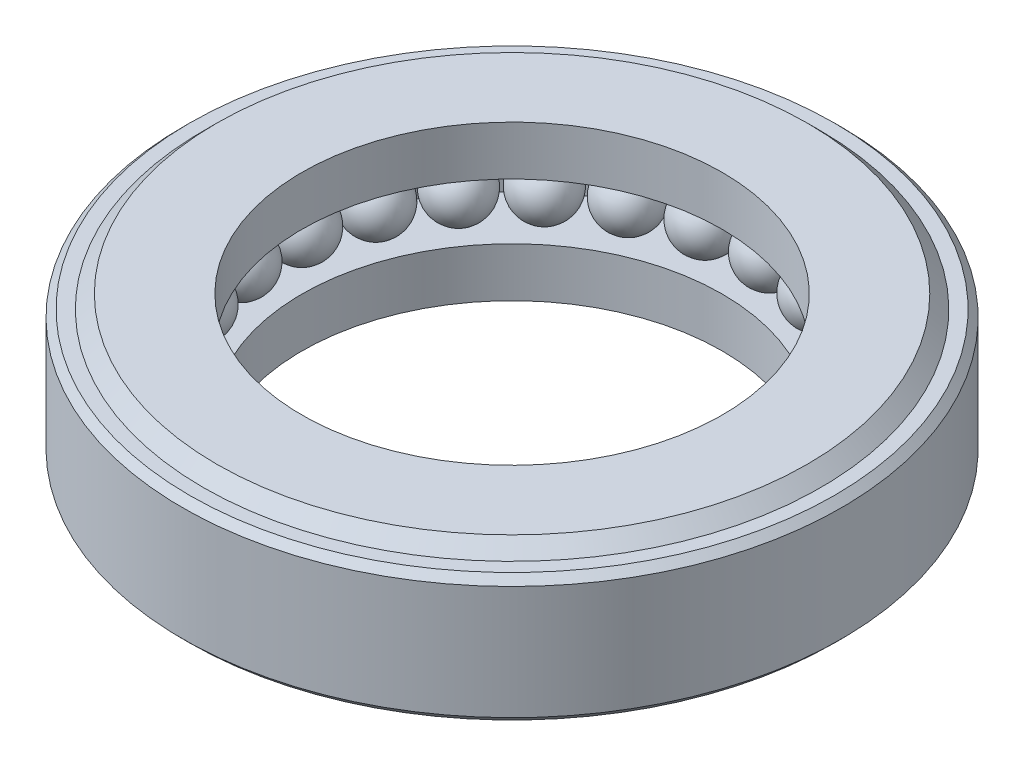
ISO-10303-21;
HEADER;
FILE_DESCRIPTION(('STEP AP214'),'2;1');
FILE_NAME('part.step','',(''),(''),'','','');
FILE_SCHEMA(('AUTOMOTIVE_DESIGN { 1 0 10303 214 1 1 1 1 }'));
ENDSEC;
DATA;
#1=APPLICATION_CONTEXT('core data for automotive mechanical design processes');
#2=APPLICATION_PROTOCOL_DEFINITION('international standard','automotive_design',2000,#1);
#3=PRODUCT_CONTEXT('',#1,'mechanical');
#4=PRODUCT('Part','Part','',(#3));
#5=PRODUCT_RELATED_PRODUCT_CATEGORY('part','',(#4));
#6=PRODUCT_DEFINITION_FORMATION('','',#4);
#7=PRODUCT_DEFINITION_CONTEXT('part definition',#1,'design');
#8=PRODUCT_DEFINITION('design','',#6,#7);
#9=PRODUCT_DEFINITION_SHAPE('','',#8);
#10=(LENGTH_UNIT() NAMED_UNIT(*) SI_UNIT(.MILLI.,.METRE.));
#11=(NAMED_UNIT(*) PLANE_ANGLE_UNIT() SI_UNIT($,.RADIAN.));
#12=(NAMED_UNIT(*) SI_UNIT($,.STERADIAN.) SOLID_ANGLE_UNIT());
#13=UNCERTAINTY_MEASURE_WITH_UNIT(LENGTH_MEASURE(1.E-05),#10,'distance_accuracy_value','');
#14=(GEOMETRIC_REPRESENTATION_CONTEXT(3) GLOBAL_UNCERTAINTY_ASSIGNED_CONTEXT((#13)) GLOBAL_UNIT_ASSIGNED_CONTEXT((#10,
#11,#12)) REPRESENTATION_CONTEXT('',''));
#15=CARTESIAN_POINT('',(0.,0.,0.));
#16=DIRECTION('',(0.,0.,1.));
#17=DIRECTION('',(1.,0.,0.));
#18=AXIS2_PLACEMENT_3D('',#15,#16,#17);
#19=CARTESIAN_POINT('',(2.635,-0.69,0.));
#20=DIRECTION('',(0.,-1.,0.));
#21=DIRECTION('',(0.,0.,-1.));
#22=AXIS2_PLACEMENT_3D('',#19,#20,#21);
#23=PLANE('',#22);
#24=CARTESIAN_POINT('',(0.,-0.69,0.));
#25=DIRECTION('',(0.,-1.,0.));
#26=DIRECTION('',(0.,0.,-1.));
#27=AXIS2_PLACEMENT_3D('',#24,#25,#26);
#28=CIRCLE('',#27,2.635);
#29=CARTESIAN_POINT('',(0.,-0.69,-2.635));
#30=VERTEX_POINT('',#29);
#31=EDGE_CURVE('E10',#30,#30,#28,.T.);
#32=ORIENTED_EDGE('',*,*,#31,.T.);
#33=EDGE_LOOP('',(#32));
#34=FACE_BOUND('',#33,.T.);
#35=CARTESIAN_POINT('',(0.,-0.69,0.));
#36=DIRECTION('',(0.,-1.,0.));
#37=DIRECTION('',(0.,0.,-1.));
#38=AXIS2_PLACEMENT_3D('',#35,#36,#37);
#39=CIRCLE('',#38,1.875);
#40=CARTESIAN_POINT('',(0.,-0.69,-1.875));
#41=VERTEX_POINT('',#40);
#42=EDGE_CURVE('E201',#41,#41,#39,.T.);
#43=ORIENTED_EDGE('',*,*,#42,.F.);
#44=EDGE_LOOP('',(#43));
#45=FACE_BOUND('',#44,.T.);
#46=ADVANCED_FACE('F34',(#34,#45),#23,.T.);
#47=CARTESIAN_POINT('',(0.,-0.69,0.));
#48=DIRECTION('',(0.,1.,0.));
#49=DIRECTION('',(0.,0.,1.));
#50=AXIS2_PLACEMENT_3D('',#47,#48,#49);
#51=CONICAL_SURFACE('',#50,2.635,0.78539816339745);
#52=CARTESIAN_POINT('',(0.,-0.57,0.));
#53=DIRECTION('',(0.,-1.,0.));
#54=DIRECTION('',(0.,0.,-1.));
#55=AXIS2_PLACEMENT_3D('',#52,#53,#54);
#56=CIRCLE('',#55,2.755);
#57=CARTESIAN_POINT('',(0.,-0.57,-2.755));
#58=VERTEX_POINT('',#57);
#59=EDGE_CURVE('E41',#58,#58,#56,.T.);
#60=ORIENTED_EDGE('',*,*,#59,.T.);
#61=EDGE_LOOP('',(#60));
#62=FACE_BOUND('',#61,.T.);
#63=ORIENTED_EDGE('',*,*,#31,.F.);
#64=EDGE_LOOP('',(#63));
#65=FACE_BOUND('',#64,.T.);
#66=ADVANCED_FACE('F251',(#62,#65),#51,.T.);
#67=CARTESIAN_POINT('',(2.8767,-0.57,0.));
#68=DIRECTION('',(0.,-1.,0.));
#69=DIRECTION('',(0.,0.,-1.));
#70=AXIS2_PLACEMENT_3D('',#67,#68,#69);
#71=PLANE('',#70);
#72=CARTESIAN_POINT('',(0.,-0.57,0.));
#73=DIRECTION('',(0.,-1.,0.));
#74=DIRECTION('',(0.,0.,-1.));
#75=AXIS2_PLACEMENT_3D('',#72,#73,#74);
#76=CIRCLE('',#75,2.8767);
#77=CARTESIAN_POINT('',(0.,-0.57,-2.8767));
#78=VERTEX_POINT('',#77);
#79=EDGE_CURVE('E46',#78,#78,#76,.T.);
#80=ORIENTED_EDGE('',*,*,#79,.T.);
#81=EDGE_LOOP('',(#80));
#82=FACE_BOUND('',#81,.T.);
#83=ORIENTED_EDGE('',*,*,#59,.F.);
#84=EDGE_LOOP('',(#83));
#85=FACE_BOUND('',#84,.T.);
#86=ADVANCED_FACE('F236',(#82,#85),#71,.T.);
#87=CARTESIAN_POINT('',(0.,-0.57,0.));
#88=DIRECTION('',(0.,1.,0.));
#89=DIRECTION('',(0.,0.,1.));
#90=AXIS2_PLACEMENT_3D('',#87,#88,#89);
#91=CONICAL_SURFACE('',#90,2.8767,0.78539816339745);
#92=CARTESIAN_POINT('',(0.,-0.5067,0.));
#93=DIRECTION('',(0.,-1.,0.));
#94=DIRECTION('',(0.,0.,-1.));
#95=AXIS2_PLACEMENT_3D('',#92,#93,#94);
#96=CIRCLE('',#95,2.94);
#97=CARTESIAN_POINT('',(0.,-0.5067,-2.94));
#98=VERTEX_POINT('',#97);
#99=EDGE_CURVE('E231',#98,#98,#96,.T.);
#100=ORIENTED_EDGE('',*,*,#99,.T.);
#101=EDGE_LOOP('',(#100));
#102=FACE_BOUND('',#101,.T.);
#103=ORIENTED_EDGE('',*,*,#79,.F.);
#104=EDGE_LOOP('',(#103));
#105=FACE_BOUND('',#104,.T.);
#106=ADVANCED_FACE('F239',(#102,#105),#91,.T.);
#107=CARTESIAN_POINT('',(0.,0.,0.));
#108=DIRECTION('',(0.,-1.,0.));
#109=DIRECTION('',(0.,0.,-1.));
#110=AXIS2_PLACEMENT_3D('',#107,#108,#109);
#111=CYLINDRICAL_SURFACE('',#110,2.94);
#112=CARTESIAN_POINT('',(0.,0.5067,0.));
#113=DIRECTION('',(0.,-1.,0.));
#114=DIRECTION('',(0.,0.,-1.));
#115=AXIS2_PLACEMENT_3D('',#112,#113,#114);
#116=CIRCLE('',#115,2.94);
#117=CARTESIAN_POINT('',(0.,0.5067,-2.94));
#118=VERTEX_POINT('',#117);
#119=EDGE_CURVE('E228',#118,#118,#116,.T.);
#120=ORIENTED_EDGE('',*,*,#119,.T.);
#121=EDGE_LOOP('',(#120));
#122=FACE_BOUND('',#121,.T.);
#123=ORIENTED_EDGE('',*,*,#99,.F.);
#124=EDGE_LOOP('',(#123));
#125=FACE_BOUND('',#124,.T.);
#126=ADVANCED_FACE('F241',(#122,#125),#111,.T.);
#127=CARTESIAN_POINT('',(0.,0.5067,0.));
#128=DIRECTION('',(0.,-1.,0.));
#129=DIRECTION('',(0.,0.,-1.));
#130=AXIS2_PLACEMENT_3D('',#127,#128,#129);
#131=CONICAL_SURFACE('',#130,2.94,0.785398163397451);
#132=CARTESIAN_POINT('',(0.,0.57,0.));
#133=DIRECTION('',(0.,-1.,0.));
#134=DIRECTION('',(0.,0.,-1.));
#135=AXIS2_PLACEMENT_3D('',#132,#133,#134);
#136=CIRCLE('',#135,2.8767);
#137=CARTESIAN_POINT('',(0.,0.57,-2.8767));
#138=VERTEX_POINT('',#137);
#139=EDGE_CURVE('E225',#138,#138,#136,.T.);
#140=ORIENTED_EDGE('',*,*,#139,.T.);
#141=EDGE_LOOP('',(#140));
#142=FACE_BOUND('',#141,.T.);
#143=ORIENTED_EDGE('',*,*,#119,.F.);
#144=EDGE_LOOP('',(#143));
#145=FACE_BOUND('',#144,.T.);
#146=ADVANCED_FACE('F248',(#142,#145),#131,.T.);
#147=CARTESIAN_POINT('',(2.8767,0.57,0.));
#148=DIRECTION('',(0.,1.,0.));
#149=DIRECTION('',(0.,0.,1.));
#150=AXIS2_PLACEMENT_3D('',#147,#148,#149);
#151=PLANE('',#150);
#152=CARTESIAN_POINT('',(0.,0.57,0.));
#153=DIRECTION('',(0.,-1.,0.));
#154=DIRECTION('',(0.,0.,-1.));
#155=AXIS2_PLACEMENT_3D('',#152,#153,#154);
#156=CIRCLE('',#155,2.755);
#157=CARTESIAN_POINT('',(0.,0.57,-2.755));
#158=VERTEX_POINT('',#157);
#159=EDGE_CURVE('E222',#158,#158,#156,.T.);
#160=ORIENTED_EDGE('',*,*,#159,.T.);
#161=EDGE_LOOP('',(#160));
#162=FACE_BOUND('',#161,.T.);
#163=ORIENTED_EDGE('',*,*,#139,.F.);
#164=EDGE_LOOP('',(#163));
#165=FACE_BOUND('',#164,.T.);
#166=ADVANCED_FACE('F302',(#162,#165),#151,.T.);
#167=CARTESIAN_POINT('',(0.,0.57,0.));
#168=DIRECTION('',(0.,-1.,0.));
#169=DIRECTION('',(0.,0.,-1.));
#170=AXIS2_PLACEMENT_3D('',#167,#168,#169);
#171=CONICAL_SURFACE('',#170,2.755,0.78539816339745);
#172=CARTESIAN_POINT('',(0.,0.69,0.));
#173=DIRECTION('',(0.,-1.,0.));
#174=DIRECTION('',(0.,0.,-1.));
#175=AXIS2_PLACEMENT_3D('',#172,#173,#174);
#176=CIRCLE('',#175,2.635);
#177=CARTESIAN_POINT('',(0.,0.69,-2.635));
#178=VERTEX_POINT('',#177);
#179=EDGE_CURVE('E219',#178,#178,#176,.T.);
#180=ORIENTED_EDGE('',*,*,#179,.T.);
#181=EDGE_LOOP('',(#180));
#182=FACE_BOUND('',#181,.T.);
#183=ORIENTED_EDGE('',*,*,#159,.F.);
#184=EDGE_LOOP('',(#183));
#185=FACE_BOUND('',#184,.T.);
#186=ADVANCED_FACE('F296',(#182,#185),#171,.T.);
#187=CARTESIAN_POINT('',(2.635,0.69,0.));
#188=DIRECTION('',(0.,1.,0.));
#189=DIRECTION('',(0.,0.,1.));
#190=AXIS2_PLACEMENT_3D('',#187,#188,#189);
#191=PLANE('',#190);
#192=CARTESIAN_POINT('',(0.,0.69,0.));
#193=DIRECTION('',(0.,-1.,0.));
#194=DIRECTION('',(0.,0.,-1.));
#195=AXIS2_PLACEMENT_3D('',#192,#193,#194);
#196=CIRCLE('',#195,1.875);
#197=CARTESIAN_POINT('',(0.,0.69,-1.875));
#198=VERTEX_POINT('',#197);
#199=EDGE_CURVE('E216',#198,#198,#196,.T.);
#200=ORIENTED_EDGE('',*,*,#199,.T.);
#201=EDGE_LOOP('',(#200));
#202=FACE_BOUND('',#201,.T.);
#203=ORIENTED_EDGE('',*,*,#179,.F.);
#204=EDGE_LOOP('',(#203));
#205=FACE_BOUND('',#204,.T.);
#206=ADVANCED_FACE('F290',(#202,#205),#191,.T.);
#207=CARTESIAN_POINT('',(0.,0.,0.));
#208=DIRECTION('',(0.,-1.,0.));
#209=DIRECTION('',(0.,0.,-1.));
#210=AXIS2_PLACEMENT_3D('',#207,#208,#209);
#211=CYLINDRICAL_SURFACE('',#210,1.875);
#212=CARTESIAN_POINT('',(0.,0.25,0.));
#213=DIRECTION('',(0.,-1.,0.));
#214=DIRECTION('',(0.,0.,-1.));
#215=AXIS2_PLACEMENT_3D('',#212,#213,#214);
#216=CIRCLE('',#215,1.875);
#217=CARTESIAN_POINT('',(0.,0.25,-1.875));
#218=VERTEX_POINT('',#217);
#219=EDGE_CURVE('E213',#218,#218,#216,.T.);
#220=ORIENTED_EDGE('',*,*,#219,.T.);
#221=EDGE_LOOP('',(#220));
#222=FACE_BOUND('',#221,.T.);
#223=ORIENTED_EDGE('',*,*,#199,.F.);
#224=EDGE_LOOP('',(#223));
#225=FACE_BOUND('',#224,.T.);
#226=ADVANCED_FACE('F284',(#222,#225),#211,.F.);
#227=CARTESIAN_POINT('',(2.44,0.25,0.));
#228=DIRECTION('',(0.,-1.,0.));
#229=DIRECTION('',(0.,0.,-1.));
#230=AXIS2_PLACEMENT_3D('',#227,#228,#229);
#231=PLANE('',#230);
#232=CARTESIAN_POINT('',(2.09698254384349,0.25,-0.538413605711882));
#233=DIRECTION('',(0.,-1.,0.));
#234=DIRECTION('',(0.,0.,-1.));
#235=AXIS2_PLACEMENT_3D('',#232,#233,#234);
#236=CIRCLE('',#235,0.0714142842854286);
#237=CARTESIAN_POINT('',(2.09698254384349,0.25,-0.609827889997311));
#238=VERTEX_POINT('',#237);
#239=EDGE_CURVE('E144',#238,#238,#236,.F.);
#240=ORIENTED_EDGE('',*,*,#239,.T.);
#241=EDGE_LOOP('',(#240));
#242=FACE_BOUND('',#241,.T.);
#243=CARTESIAN_POINT('',(1.89720396229498,0.25,-1.04299670443019));
#244=DIRECTION('',(0.,-1.,0.));
#245=DIRECTION('',(0.,0.,-1.));
#246=AXIS2_PLACEMENT_3D('',#243,#244,#245);
#247=CIRCLE('',#246,0.0714142842854286);
#248=CARTESIAN_POINT('',(1.89720396229498,0.25,-1.11441098871562));
#249=VERTEX_POINT('',#248);
#250=EDGE_CURVE('E141',#249,#249,#247,.F.);
#251=ORIENTED_EDGE('',*,*,#250,.T.);
#252=EDGE_LOOP('',(#251));
#253=FACE_BOUND('',#252,.T.);
#254=CARTESIAN_POINT('',(1.57821707836738,0.25,-1.48204448433559));
#255=DIRECTION('',(0.,-1.,0.));
#256=DIRECTION('',(0.,0.,-1.));
#257=AXIS2_PLACEMENT_3D('',#254,#255,#256);
#258=CIRCLE('',#257,0.0714142842854286);
#259=CARTESIAN_POINT('',(1.57821707836738,0.25,-1.55345876862102));
#260=VERTEX_POINT('',#259);
#261=EDGE_CURVE('E138',#260,#260,#258,.F.);
#262=ORIENTED_EDGE('',*,*,#261,.T.);
#263=EDGE_LOOP('',(#262));
#264=FACE_BOUND('',#263,.T.);
#265=CARTESIAN_POINT('',(1.16006501112955,0.25,-1.82796995871185));
#266=DIRECTION('',(0.,-1.,0.));
#267=DIRECTION('',(0.,0.,-1.));
#268=AXIS2_PLACEMENT_3D('',#265,#266,#267);
#269=CIRCLE('',#268,0.0714142842854286);
#270=CARTESIAN_POINT('',(1.16006501112955,0.25,-1.89938424299728));
#271=VERTEX_POINT('',#270);
#272=EDGE_CURVE('E134',#271,#271,#269,.F.);
#273=ORIENTED_EDGE('',*,*,#272,.T.);
#274=EDGE_LOOP('',(#273));
#275=FACE_BOUND('',#274,.T.);
#276=CARTESIAN_POINT('',(0.669021792821784,0.25,-2.059037357779));
#277=DIRECTION('',(0.,-1.,0.));
#278=DIRECTION('',(0.,0.,-1.));
#279=AXIS2_PLACEMENT_3D('',#276,#277,#278);
#280=CIRCLE('',#279,0.0714142842854286);
#281=CARTESIAN_POINT('',(0.669021792821784,0.25,-2.13045164206443));
#282=VERTEX_POINT('',#281);
#283=EDGE_CURVE('E130',#282,#282,#280,.F.);
#284=ORIENTED_EDGE('',*,*,#283,.T.);
#285=EDGE_LOOP('',(#284));
#286=FACE_BOUND('',#285,.T.);
#287=CARTESIAN_POINT('',(0.135941474780987,0.25,-2.16072786704721));
#288=DIRECTION('',(0.,-1.,0.));
#289=DIRECTION('',(0.,0.,-1.));
#290=AXIS2_PLACEMENT_3D('',#287,#288,#289);
#291=CIRCLE('',#290,0.0714142842854286);
#292=CARTESIAN_POINT('',(0.135941474780987,0.25,-2.23214215133263));
#293=VERTEX_POINT('',#292);
#294=EDGE_CURVE('E126',#293,#293,#291,.F.);
#295=ORIENTED_EDGE('',*,*,#294,.T.);
#296=EDGE_LOOP('',(#295));
#297=FACE_BOUND('',#296,.T.);
#298=CARTESIAN_POINT('',(-0.405680546078073,0.25,-2.12665189782762));
#299=DIRECTION('',(0.,-1.,0.));
#300=DIRECTION('',(0.,0.,-1.));
#301=AXIS2_PLACEMENT_3D('',#298,#299,#300);
#302=CIRCLE('',#301,0.0714142842854286);
#303=CARTESIAN_POINT('',(-0.405680546078073,0.25,-2.19806618211304));
#304=VERTEX_POINT('',#303);
#305=EDGE_CURVE('E122',#304,#304,#302,.F.);
#306=ORIENTED_EDGE('',*,*,#305,.T.);
#307=EDGE_LOOP('',(#306));
#308=FACE_BOUND('',#307,.T.);
#309=CARTESIAN_POINT('',(-0.921812166238364,0.25,-1.95895056858894));
#310=DIRECTION('',(0.,-1.,0.));
#311=DIRECTION('',(0.,0.,-1.));
#312=AXIS2_PLACEMENT_3D('',#309,#310,#311);
#313=CIRCLE('',#312,0.0714142842854286);
#314=CARTESIAN_POINT('',(-0.921812166238364,0.25,-2.03036485287437));
#315=VERTEX_POINT('',#314);
#316=EDGE_CURVE('E118',#315,#315,#313,.F.);
#317=ORIENTED_EDGE('',*,*,#316,.T.);
#318=EDGE_LOOP('',(#317));
#319=FACE_BOUND('',#318,.T.);
#320=CARTESIAN_POINT('',(-1.3800229378059,0.25,-1.6681611706096));
#321=DIRECTION('',(0.,-1.,0.));
#322=DIRECTION('',(0.,0.,-1.));
#323=AXIS2_PLACEMENT_3D('',#320,#321,#322);
#324=CIRCLE('',#323,0.0714142842854286);
#325=CARTESIAN_POINT('',(-1.3800229378059,0.25,-1.73957545489502));
#326=VERTEX_POINT('',#325);
#327=EDGE_CURVE('E114',#326,#326,#324,.F.);
#328=ORIENTED_EDGE('',*,*,#327,.T.);
#329=EDGE_LOOP('',(#328));
#330=FACE_BOUND('',#329,.T.);
#331=CARTESIAN_POINT('',(-1.75152179282175,0.25,-1.27255507121322));
#332=DIRECTION('',(0.,-1.,0.));
#333=DIRECTION('',(0.,0.,-1.));
#334=AXIS2_PLACEMENT_3D('',#331,#332,#333);
#335=CIRCLE('',#334,0.0714142842854286);
#336=CARTESIAN_POINT('',(-1.75152179282175,0.25,-1.34396935549865));
#337=VERTEX_POINT('',#336);
#338=EDGE_CURVE('E110',#337,#337,#335,.F.);
#339=ORIENTED_EDGE('',*,*,#338,.T.);
#340=EDGE_LOOP('',(#339));
#341=FACE_BOUND('',#340,.T.);
#342=CARTESIAN_POINT('',(-2.01296609194806,0.25,-0.796989656562344));
#343=DIRECTION('',(0.,-1.,0.));
#344=DIRECTION('',(0.,0.,-1.));
#345=AXIS2_PLACEMENT_3D('',#342,#343,#344);
#346=CIRCLE('',#345,0.0714142842854286);
#347=CARTESIAN_POINT('',(-2.01296609194806,0.25,-0.868403940847772));
#348=VERTEX_POINT('',#347);
#349=EDGE_CURVE('E106',#348,#348,#346,.F.);
#350=ORIENTED_EDGE('',*,*,#349,.T.);
#351=EDGE_LOOP('',(#350));
#352=FACE_BOUND('',#351,.T.);
#353=CARTESIAN_POINT('',(-2.14792832834584,0.25,-0.271346450666734));
#354=DIRECTION('',(0.,-1.,0.));
#355=DIRECTION('',(0.,0.,-1.));
#356=AXIS2_PLACEMENT_3D('',#353,#354,#355);
#357=CIRCLE('',#356,0.0714142842854286);
#358=CARTESIAN_POINT('',(-2.14792832834584,0.25,-0.342760734952163));
#359=VERTEX_POINT('',#358);
#360=EDGE_CURVE('E102',#359,#359,#357,.F.);
#361=ORIENTED_EDGE('',*,*,#360,.T.);
#362=EDGE_LOOP('',(#361));
#363=FACE_BOUND('',#362,.T.);
#364=CARTESIAN_POINT('',(-2.14792832834585,0.25,0.271346450666704));
#365=DIRECTION('',(0.,-1.,0.));
#366=DIRECTION('',(0.,0.,-1.));
#367=AXIS2_PLACEMENT_3D('',#364,#365,#366);
#368=CIRCLE('',#367,0.0714142842854286);
#369=CARTESIAN_POINT('',(-2.14792832834585,0.25,0.199932166381275));
#370=VERTEX_POINT('',#369);
#371=EDGE_CURVE('E98',#370,#370,#368,.F.);
#372=ORIENTED_EDGE('',*,*,#371,.T.);
#373=EDGE_LOOP('',(#372));
#374=FACE_BOUND('',#373,.T.);
#375=CARTESIAN_POINT('',(-2.01296609194807,0.25,0.796989656562315));
#376=DIRECTION('',(0.,-1.,0.));
#377=DIRECTION('',(0.,0.,-1.));
#378=AXIS2_PLACEMENT_3D('',#375,#376,#377);
#379=CIRCLE('',#378,0.0714142842854286);
#380=CARTESIAN_POINT('',(-2.01296609194807,0.25,0.725575372276886));
#381=VERTEX_POINT('',#380);
#382=EDGE_CURVE('E94',#381,#381,#379,.F.);
#383=ORIENTED_EDGE('',*,*,#382,.T.);
#384=EDGE_LOOP('',(#383));
#385=FACE_BOUND('',#384,.T.);
#386=CARTESIAN_POINT('',(-1.75152179282177,0.25,1.27255507121319));
#387=DIRECTION('',(0.,-1.,0.));
#388=DIRECTION('',(0.,0.,-1.));
#389=AXIS2_PLACEMENT_3D('',#386,#387,#388);
#390=CIRCLE('',#389,0.0714142842854286);
#391=CARTESIAN_POINT('',(-1.75152179282177,0.25,1.20114078692777));
#392=VERTEX_POINT('',#391);
#393=EDGE_CURVE('E90',#392,#392,#390,.F.);
#394=ORIENTED_EDGE('',*,*,#393,.T.);
#395=EDGE_LOOP('',(#394));
#396=FACE_BOUND('',#395,.T.);
#397=CARTESIAN_POINT('',(-1.38002293780592,0.25,1.66816117060958));
#398=DIRECTION('',(0.,-1.,0.));
#399=DIRECTION('',(0.,0.,-1.));
#400=AXIS2_PLACEMENT_3D('',#397,#398,#399);
#401=CIRCLE('',#400,0.0714142842854286);
#402=CARTESIAN_POINT('',(-1.38002293780592,0.25,1.59674688632415));
#403=VERTEX_POINT('',#402);
#404=EDGE_CURVE('E86',#403,#403,#401,.F.);
#405=ORIENTED_EDGE('',*,*,#404,.T.);
#406=EDGE_LOOP('',(#405));
#407=FACE_BOUND('',#406,.T.);
#408=CARTESIAN_POINT('',(-0.921812166238391,0.25,1.95895056858893));
#409=DIRECTION('',(0.,-1.,0.));
#410=DIRECTION('',(0.,0.,-1.));
#411=AXIS2_PLACEMENT_3D('',#408,#409,#410);
#412=CIRCLE('',#411,0.0714142842854286);
#413=CARTESIAN_POINT('',(-0.921812166238391,0.25,1.8875362843035));
#414=VERTEX_POINT('',#413);
#415=EDGE_CURVE('E82',#414,#414,#412,.F.);
#416=ORIENTED_EDGE('',*,*,#415,.T.);
#417=EDGE_LOOP('',(#416));
#418=FACE_BOUND('',#417,.T.);
#419=CARTESIAN_POINT('',(-0.405680546078102,0.25,2.12665189782761));
#420=DIRECTION('',(0.,-1.,0.));
#421=DIRECTION('',(0.,0.,-1.));
#422=AXIS2_PLACEMENT_3D('',#419,#420,#421);
#423=CIRCLE('',#422,0.0714142842854286);
#424=CARTESIAN_POINT('',(-0.405680546078102,0.25,2.05523761354218));
#425=VERTEX_POINT('',#424);
#426=EDGE_CURVE('E78',#425,#425,#423,.F.);
#427=ORIENTED_EDGE('',*,*,#426,.T.);
#428=EDGE_LOOP('',(#427));
#429=FACE_BOUND('',#428,.T.);
#430=CARTESIAN_POINT('',(0.135941474780956,0.25,2.16072786704721));
#431=DIRECTION('',(0.,-1.,0.));
#432=DIRECTION('',(0.,0.,-1.));
#433=AXIS2_PLACEMENT_3D('',#430,#431,#432);
#434=CIRCLE('',#433,0.0714142842854286);
#435=CARTESIAN_POINT('',(0.135941474780956,0.25,2.08931358276178));
#436=VERTEX_POINT('',#435);
#437=EDGE_CURVE('E74',#436,#436,#434,.F.);
#438=ORIENTED_EDGE('',*,*,#437,.T.);
#439=EDGE_LOOP('',(#438));
#440=FACE_BOUND('',#439,.T.);
#441=CARTESIAN_POINT('',(0.669021792821755,0.25,2.05903735777901));
#442=DIRECTION('',(0.,-1.,0.));
#443=DIRECTION('',(0.,0.,-1.));
#444=AXIS2_PLACEMENT_3D('',#441,#442,#443);
#445=CIRCLE('',#444,0.0714142842854286);
#446=CARTESIAN_POINT('',(0.669021792821755,0.25,1.98762307349358));
#447=VERTEX_POINT('',#446);
#448=EDGE_CURVE('E70',#447,#447,#445,.F.);
#449=ORIENTED_EDGE('',*,*,#448,.T.);
#450=EDGE_LOOP('',(#449));
#451=FACE_BOUND('',#450,.T.);
#452=CARTESIAN_POINT('',(1.16006501112952,0.25,1.82796995871187));
#453=DIRECTION('',(0.,-1.,0.));
#454=DIRECTION('',(0.,0.,-1.));
#455=AXIS2_PLACEMENT_3D('',#452,#453,#454);
#456=CIRCLE('',#455,0.0714142842854286);
#457=CARTESIAN_POINT('',(1.16006501112952,0.25,1.75655567442644));
#458=VERTEX_POINT('',#457);
#459=EDGE_CURVE('E66',#458,#458,#456,.F.);
#460=ORIENTED_EDGE('',*,*,#459,.T.);
#461=EDGE_LOOP('',(#460));
#462=FACE_BOUND('',#461,.T.);
#463=CARTESIAN_POINT('',(1.57821707836735,0.25,1.48204448433561));
#464=DIRECTION('',(0.,-1.,0.));
#465=DIRECTION('',(0.,0.,-1.));
#466=AXIS2_PLACEMENT_3D('',#463,#464,#465);
#467=CIRCLE('',#466,0.0714142842854286);
#468=CARTESIAN_POINT('',(1.57821707836735,0.25,1.41063020005018));
#469=VERTEX_POINT('',#468);
#470=EDGE_CURVE('E62',#469,#469,#467,.F.);
#471=ORIENTED_EDGE('',*,*,#470,.T.);
#472=EDGE_LOOP('',(#471));
#473=FACE_BOUND('',#472,.T.);
#474=CARTESIAN_POINT('',(1.89720396229496,0.25,1.04299670443022));
#475=DIRECTION('',(0.,-1.,0.));
#476=DIRECTION('',(0.,0.,-1.));
#477=AXIS2_PLACEMENT_3D('',#474,#475,#476);
#478=CIRCLE('',#477,0.0714142842854286);
#479=CARTESIAN_POINT('',(1.89720396229496,0.25,0.971582420144787));
#480=VERTEX_POINT('',#479);
#481=EDGE_CURVE('E58',#480,#480,#478,.F.);
#482=ORIENTED_EDGE('',*,*,#481,.T.);
#483=EDGE_LOOP('',(#482));
#484=FACE_BOUND('',#483,.T.);
#485=CARTESIAN_POINT('',(2.09698254384349,0.25,0.538413605711912));
#486=DIRECTION('',(0.,-1.,0.));
#487=DIRECTION('',(0.,0.,-1.));
#488=AXIS2_PLACEMENT_3D('',#485,#486,#487);
#489=CIRCLE('',#488,0.0714142842854286);
#490=CARTESIAN_POINT('',(2.09698254384349,0.25,0.466999321426483));
#491=VERTEX_POINT('',#490);
#492=EDGE_CURVE('E54',#491,#491,#489,.F.);
#493=ORIENTED_EDGE('',*,*,#492,.T.);
#494=EDGE_LOOP('',(#493));
#495=FACE_BOUND('',#494,.T.);
#496=CARTESIAN_POINT('',(2.165,0.25,0.));
#497=DIRECTION('',(0.,-1.,0.));
#498=DIRECTION('',(0.,0.,-1.));
#499=AXIS2_PLACEMENT_3D('',#496,#497,#498);
#500=CIRCLE('',#499,0.0714142842854286);
#501=CARTESIAN_POINT('',(2.165,0.25,-0.0714142842854286));
#502=VERTEX_POINT('',#501);
#503=EDGE_CURVE('E53',#502,#502,#500,.F.);
#504=ORIENTED_EDGE('',*,*,#503,.T.);
#505=EDGE_LOOP('',(#504));
#506=FACE_BOUND('',#505,.T.);
#507=CARTESIAN_POINT('',(0.,0.25,0.));
#508=DIRECTION('',(0.,-1.,0.));
#509=DIRECTION('',(0.,0.,-1.));
#510=AXIS2_PLACEMENT_3D('',#507,#508,#509);
#511=CIRCLE('',#510,2.44);
#512=CARTESIAN_POINT('',(0.,0.25,-2.44));
#513=VERTEX_POINT('',#512);
#514=EDGE_CURVE('E210',#513,#513,#511,.T.);
#515=ORIENTED_EDGE('',*,*,#514,.T.);
#516=EDGE_LOOP('',(#515));
#517=FACE_BOUND('',#516,.T.);
#518=ORIENTED_EDGE('',*,*,#219,.F.);
#519=EDGE_LOOP('',(#518));
#520=FACE_BOUND('',#519,.T.);
#521=ADVANCED_FACE('F278',(#242,#253,#264,#275,#286,#297,#308,#319,#330,#341,#352,#363,#374,
#385,#396,#407,#418,#429,#440,#451,#462,#473,#484,#495,#506,#517,#520),#231,.T.);
#522=CARTESIAN_POINT('',(0.,0.,0.));
#523=DIRECTION('',(0.,-1.,0.));
#524=DIRECTION('',(0.,0.,-1.));
#525=AXIS2_PLACEMENT_3D('',#522,#523,#524);
#526=CYLINDRICAL_SURFACE('',#525,2.44);
#527=CARTESIAN_POINT('',(0.,-0.25,0.));
#528=DIRECTION('',(0.,-1.,0.));
#529=DIRECTION('',(0.,0.,-1.));
#530=AXIS2_PLACEMENT_3D('',#527,#528,#529);
#531=CIRCLE('',#530,2.44);
#532=CARTESIAN_POINT('',(0.,-0.25,-2.44));
#533=VERTEX_POINT('',#532);
#534=EDGE_CURVE('E207',#533,#533,#531,.T.);
#535=ORIENTED_EDGE('',*,*,#534,.T.);
#536=EDGE_LOOP('',(#535));
#537=FACE_BOUND('',#536,.T.);
#538=ORIENTED_EDGE('',*,*,#514,.F.);
#539=EDGE_LOOP('',(#538));
#540=FACE_BOUND('',#539,.T.);
#541=ADVANCED_FACE('F271',(#537,#540),#526,.F.);
#542=CARTESIAN_POINT('',(2.44,-0.25,0.));
#543=DIRECTION('',(0.,1.,0.));
#544=DIRECTION('',(0.,0.,1.));
#545=AXIS2_PLACEMENT_3D('',#542,#543,#544);
#546=PLANE('',#545);
#547=CARTESIAN_POINT('',(2.09698254384349,-0.25,-0.538413605711882));
#548=DIRECTION('',(0.,1.,0.));
#549=DIRECTION('',(0.,0.,1.));
#550=AXIS2_PLACEMENT_3D('',#547,#548,#549);
#551=CIRCLE('',#550,0.0714142842854286);
#552=CARTESIAN_POINT('',(2.09698254384349,-0.25,-0.466999321426453));
#553=VERTEX_POINT('',#552);
#554=EDGE_CURVE('E37',#553,#553,#551,.F.);
#555=ORIENTED_EDGE('',*,*,#554,.T.);
#556=EDGE_LOOP('',(#555));
#557=FACE_BOUND('',#556,.T.);
#558=CARTESIAN_POINT('',(1.89720396229498,-0.25,-1.04299670443019));
#559=DIRECTION('',(0.,1.,0.));
#560=DIRECTION('',(0.,0.,1.));
#561=AXIS2_PLACEMENT_3D('',#558,#559,#560);
#562=CIRCLE('',#561,0.0714142842854286);
#563=CARTESIAN_POINT('',(1.89720396229498,-0.25,-0.97158242014476));
#564=VERTEX_POINT('',#563);
#565=EDGE_CURVE('E142',#564,#564,#562,.F.);
#566=ORIENTED_EDGE('',*,*,#565,.T.);
#567=EDGE_LOOP('',(#566));
#568=FACE_BOUND('',#567,.T.);
#569=CARTESIAN_POINT('',(1.57821707836738,-0.25,-1.48204448433559));
#570=DIRECTION('',(0.,1.,0.));
#571=DIRECTION('',(0.,0.,1.));
#572=AXIS2_PLACEMENT_3D('',#569,#570,#571);
#573=CIRCLE('',#572,0.0714142842854286);
#574=CARTESIAN_POINT('',(1.57821707836738,-0.25,-1.41063020005016));
#575=VERTEX_POINT('',#574);
#576=EDGE_CURVE('E139',#575,#575,#573,.F.);
#577=ORIENTED_EDGE('',*,*,#576,.T.);
#578=EDGE_LOOP('',(#577));
#579=FACE_BOUND('',#578,.T.);
#580=CARTESIAN_POINT('',(1.16006501112955,-0.25,-1.82796995871185));
#581=DIRECTION('',(0.,1.,0.));
#582=DIRECTION('',(0.,0.,1.));
#583=AXIS2_PLACEMENT_3D('',#580,#581,#582);
#584=CIRCLE('',#583,0.0714142842854286);
#585=CARTESIAN_POINT('',(1.16006501112955,-0.25,-1.75655567442642));
#586=VERTEX_POINT('',#585);
#587=EDGE_CURVE('E135',#586,#586,#584,.F.);
#588=ORIENTED_EDGE('',*,*,#587,.T.);
#589=EDGE_LOOP('',(#588));
#590=FACE_BOUND('',#589,.T.);
#591=CARTESIAN_POINT('',(0.669021792821784,-0.25,-2.059037357779));
#592=DIRECTION('',(0.,1.,0.));
#593=DIRECTION('',(0.,0.,1.));
#594=AXIS2_PLACEMENT_3D('',#591,#592,#593);
#595=CIRCLE('',#594,0.0714142842854286);
#596=CARTESIAN_POINT('',(0.669021792821784,-0.25,-1.98762307349357));
#597=VERTEX_POINT('',#596);
#598=EDGE_CURVE('E131',#597,#597,#595,.F.);
#599=ORIENTED_EDGE('',*,*,#598,.T.);
#600=EDGE_LOOP('',(#599));
#601=FACE_BOUND('',#600,.T.);
#602=CARTESIAN_POINT('',(0.135941474780987,-0.25,-2.16072786704721));
#603=DIRECTION('',(0.,1.,0.));
#604=DIRECTION('',(0.,0.,1.));
#605=AXIS2_PLACEMENT_3D('',#602,#603,#604);
#606=CIRCLE('',#605,0.0714142842854286);
#607=CARTESIAN_POINT('',(0.135941474780987,-0.25,-2.08931358276178));
#608=VERTEX_POINT('',#607);
#609=EDGE_CURVE('E127',#608,#608,#606,.F.);
#610=ORIENTED_EDGE('',*,*,#609,.T.);
#611=EDGE_LOOP('',(#610));
#612=FACE_BOUND('',#611,.T.);
#613=CARTESIAN_POINT('',(-0.405680546078073,-0.25,-2.12665189782762));
#614=DIRECTION('',(0.,1.,0.));
#615=DIRECTION('',(0.,0.,1.));
#616=AXIS2_PLACEMENT_3D('',#613,#614,#615);
#617=CIRCLE('',#616,0.0714142842854286);
#618=CARTESIAN_POINT('',(-0.405680546078073,-0.25,-2.05523761354219));
#619=VERTEX_POINT('',#618);
#620=EDGE_CURVE('E123',#619,#619,#617,.F.);
#621=ORIENTED_EDGE('',*,*,#620,.T.);
#622=EDGE_LOOP('',(#621));
#623=FACE_BOUND('',#622,.T.);
#624=CARTESIAN_POINT('',(-0.921812166238364,-0.25,-1.95895056858894));
#625=DIRECTION('',(0.,1.,0.));
#626=DIRECTION('',(0.,0.,1.));
#627=AXIS2_PLACEMENT_3D('',#624,#625,#626);
#628=CIRCLE('',#627,0.0714142842854286);
#629=CARTESIAN_POINT('',(-0.921812166238364,-0.25,-1.88753628430351));
#630=VERTEX_POINT('',#629);
#631=EDGE_CURVE('E119',#630,#630,#628,.F.);
#632=ORIENTED_EDGE('',*,*,#631,.T.);
#633=EDGE_LOOP('',(#632));
#634=FACE_BOUND('',#633,.T.);
#635=CARTESIAN_POINT('',(-1.3800229378059,-0.25,-1.6681611706096));
#636=DIRECTION('',(0.,1.,0.));
#637=DIRECTION('',(0.,0.,1.));
#638=AXIS2_PLACEMENT_3D('',#635,#636,#637);
#639=CIRCLE('',#638,0.0714142842854286);
#640=CARTESIAN_POINT('',(-1.3800229378059,-0.25,-1.59674688632417));
#641=VERTEX_POINT('',#640);
#642=EDGE_CURVE('E115',#641,#641,#639,.F.);
#643=ORIENTED_EDGE('',*,*,#642,.T.);
#644=EDGE_LOOP('',(#643));
#645=FACE_BOUND('',#644,.T.);
#646=CARTESIAN_POINT('',(-1.75152179282175,-0.25,-1.27255507121322));
#647=DIRECTION('',(0.,1.,0.));
#648=DIRECTION('',(0.,0.,1.));
#649=AXIS2_PLACEMENT_3D('',#646,#647,#648);
#650=CIRCLE('',#649,0.0714142842854286);
#651=CARTESIAN_POINT('',(-1.75152179282175,-0.25,-1.20114078692779));
#652=VERTEX_POINT('',#651);
#653=EDGE_CURVE('E111',#652,#652,#650,.F.);
#654=ORIENTED_EDGE('',*,*,#653,.T.);
#655=EDGE_LOOP('',(#654));
#656=FACE_BOUND('',#655,.T.);
#657=CARTESIAN_POINT('',(-2.01296609194806,-0.25,-0.796989656562344));
#658=DIRECTION('',(0.,1.,0.));
#659=DIRECTION('',(0.,0.,1.));
#660=AXIS2_PLACEMENT_3D('',#657,#658,#659);
#661=CIRCLE('',#660,0.0714142842854286);
#662=CARTESIAN_POINT('',(-2.01296609194806,-0.25,-0.725575372276915));
#663=VERTEX_POINT('',#662);
#664=EDGE_CURVE('E107',#663,#663,#661,.F.);
#665=ORIENTED_EDGE('',*,*,#664,.T.);
#666=EDGE_LOOP('',(#665));
#667=FACE_BOUND('',#666,.T.);
#668=CARTESIAN_POINT('',(-2.14792832834584,-0.25,-0.271346450666734));
#669=DIRECTION('',(0.,1.,0.));
#670=DIRECTION('',(0.,0.,1.));
#671=AXIS2_PLACEMENT_3D('',#668,#669,#670);
#672=CIRCLE('',#671,0.0714142842854286);
#673=CARTESIAN_POINT('',(-2.14792832834584,-0.25,-0.199932166381305));
#674=VERTEX_POINT('',#673);
#675=EDGE_CURVE('E103',#674,#674,#672,.F.);
#676=ORIENTED_EDGE('',*,*,#675,.T.);
#677=EDGE_LOOP('',(#676));
#678=FACE_BOUND('',#677,.T.);
#679=CARTESIAN_POINT('',(-2.14792832834585,-0.25,0.271346450666704));
#680=DIRECTION('',(0.,1.,0.));
#681=DIRECTION('',(0.,0.,1.));
#682=AXIS2_PLACEMENT_3D('',#679,#680,#681);
#683=CIRCLE('',#682,0.0714142842854286);
#684=CARTESIAN_POINT('',(-2.14792832834585,-0.25,0.342760734952133));
#685=VERTEX_POINT('',#684);
#686=EDGE_CURVE('E99',#685,#685,#683,.F.);
#687=ORIENTED_EDGE('',*,*,#686,.T.);
#688=EDGE_LOOP('',(#687));
#689=FACE_BOUND('',#688,.T.);
#690=CARTESIAN_POINT('',(-2.01296609194807,-0.25,0.796989656562315));
#691=DIRECTION('',(0.,1.,0.));
#692=DIRECTION('',(0.,0.,1.));
#693=AXIS2_PLACEMENT_3D('',#690,#691,#692);
#694=CIRCLE('',#693,0.0714142842854286);
#695=CARTESIAN_POINT('',(-2.01296609194807,-0.25,0.868403940847743));
#696=VERTEX_POINT('',#695);
#697=EDGE_CURVE('E95',#696,#696,#694,.F.);
#698=ORIENTED_EDGE('',*,*,#697,.T.);
#699=EDGE_LOOP('',(#698));
#700=FACE_BOUND('',#699,.T.);
#701=CARTESIAN_POINT('',(-1.75152179282177,-0.25,1.27255507121319));
#702=DIRECTION('',(0.,1.,0.));
#703=DIRECTION('',(0.,0.,1.));
#704=AXIS2_PLACEMENT_3D('',#701,#702,#703);
#705=CIRCLE('',#704,0.0714142842854286);
#706=CARTESIAN_POINT('',(-1.75152179282177,-0.25,1.34396935549862));
#707=VERTEX_POINT('',#706);
#708=EDGE_CURVE('E91',#707,#707,#705,.F.);
#709=ORIENTED_EDGE('',*,*,#708,.T.);
#710=EDGE_LOOP('',(#709));
#711=FACE_BOUND('',#710,.T.);
#712=CARTESIAN_POINT('',(-1.38002293780592,-0.25,1.66816117060958));
#713=DIRECTION('',(0.,1.,0.));
#714=DIRECTION('',(0.,0.,1.));
#715=AXIS2_PLACEMENT_3D('',#712,#713,#714);
#716=CIRCLE('',#715,0.0714142842854286);
#717=CARTESIAN_POINT('',(-1.38002293780592,-0.25,1.73957545489501));
#718=VERTEX_POINT('',#717);
#719=EDGE_CURVE('E87',#718,#718,#716,.F.);
#720=ORIENTED_EDGE('',*,*,#719,.T.);
#721=EDGE_LOOP('',(#720));
#722=FACE_BOUND('',#721,.T.);
#723=CARTESIAN_POINT('',(-0.921812166238391,-0.25,1.95895056858893));
#724=DIRECTION('',(0.,1.,0.));
#725=DIRECTION('',(0.,0.,1.));
#726=AXIS2_PLACEMENT_3D('',#723,#724,#725);
#727=CIRCLE('',#726,0.0714142842854286);
#728=CARTESIAN_POINT('',(-0.921812166238391,-0.25,2.03036485287436));
#729=VERTEX_POINT('',#728);
#730=EDGE_CURVE('E83',#729,#729,#727,.F.);
#731=ORIENTED_EDGE('',*,*,#730,.T.);
#732=EDGE_LOOP('',(#731));
#733=FACE_BOUND('',#732,.T.);
#734=CARTESIAN_POINT('',(-0.405680546078102,-0.25,2.12665189782761));
#735=DIRECTION('',(0.,1.,0.));
#736=DIRECTION('',(0.,0.,1.));
#737=AXIS2_PLACEMENT_3D('',#734,#735,#736);
#738=CIRCLE('',#737,0.0714142842854286);
#739=CARTESIAN_POINT('',(-0.405680546078102,-0.25,2.19806618211304));
#740=VERTEX_POINT('',#739);
#741=EDGE_CURVE('E79',#740,#740,#738,.F.);
#742=ORIENTED_EDGE('',*,*,#741,.T.);
#743=EDGE_LOOP('',(#742));
#744=FACE_BOUND('',#743,.T.);
#745=CARTESIAN_POINT('',(0.135941474780956,-0.25,2.16072786704721));
#746=DIRECTION('',(0.,1.,0.));
#747=DIRECTION('',(0.,0.,1.));
#748=AXIS2_PLACEMENT_3D('',#745,#746,#747);
#749=CIRCLE('',#748,0.0714142842854286);
#750=CARTESIAN_POINT('',(0.135941474780956,-0.25,2.23214215133264));
#751=VERTEX_POINT('',#750);
#752=EDGE_CURVE('E75',#751,#751,#749,.F.);
#753=ORIENTED_EDGE('',*,*,#752,.T.);
#754=EDGE_LOOP('',(#753));
#755=FACE_BOUND('',#754,.T.);
#756=CARTESIAN_POINT('',(0.669021792821755,-0.25,2.05903735777901));
#757=DIRECTION('',(0.,1.,0.));
#758=DIRECTION('',(0.,0.,1.));
#759=AXIS2_PLACEMENT_3D('',#756,#757,#758);
#760=CIRCLE('',#759,0.0714142842854286);
#761=CARTESIAN_POINT('',(0.669021792821755,-0.25,2.13045164206444));
#762=VERTEX_POINT('',#761);
#763=EDGE_CURVE('E71',#762,#762,#760,.F.);
#764=ORIENTED_EDGE('',*,*,#763,.T.);
#765=EDGE_LOOP('',(#764));
#766=FACE_BOUND('',#765,.T.);
#767=CARTESIAN_POINT('',(1.16006501112952,-0.25,1.82796995871187));
#768=DIRECTION('',(0.,1.,0.));
#769=DIRECTION('',(0.,0.,1.));
#770=AXIS2_PLACEMENT_3D('',#767,#768,#769);
#771=CIRCLE('',#770,0.0714142842854286);
#772=CARTESIAN_POINT('',(1.16006501112952,-0.25,1.89938424299729));
#773=VERTEX_POINT('',#772);
#774=EDGE_CURVE('E67',#773,#773,#771,.F.);
#775=ORIENTED_EDGE('',*,*,#774,.T.);
#776=EDGE_LOOP('',(#775));
#777=FACE_BOUND('',#776,.T.);
#778=CARTESIAN_POINT('',(1.57821707836735,-0.25,1.48204448433561));
#779=DIRECTION('',(0.,1.,0.));
#780=DIRECTION('',(0.,0.,1.));
#781=AXIS2_PLACEMENT_3D('',#778,#779,#780);
#782=CIRCLE('',#781,0.0714142842854286);
#783=CARTESIAN_POINT('',(1.57821707836735,-0.25,1.55345876862104));
#784=VERTEX_POINT('',#783);
#785=EDGE_CURVE('E63',#784,#784,#782,.F.);
#786=ORIENTED_EDGE('',*,*,#785,.T.);
#787=EDGE_LOOP('',(#786));
#788=FACE_BOUND('',#787,.T.);
#789=CARTESIAN_POINT('',(1.89720396229496,-0.25,1.04299670443022));
#790=DIRECTION('',(0.,1.,0.));
#791=DIRECTION('',(0.,0.,1.));
#792=AXIS2_PLACEMENT_3D('',#789,#790,#791);
#793=CIRCLE('',#792,0.0714142842854286);
#794=CARTESIAN_POINT('',(1.89720396229496,-0.25,1.11441098871564));
#795=VERTEX_POINT('',#794);
#796=EDGE_CURVE('E59',#795,#795,#793,.F.);
#797=ORIENTED_EDGE('',*,*,#796,.T.);
#798=EDGE_LOOP('',(#797));
#799=FACE_BOUND('',#798,.T.);
#800=CARTESIAN_POINT('',(2.09698254384349,-0.25,0.538413605711912));
#801=DIRECTION('',(0.,1.,0.));
#802=DIRECTION('',(0.,0.,1.));
#803=AXIS2_PLACEMENT_3D('',#800,#801,#802);
#804=CIRCLE('',#803,0.0714142842854286);
#805=CARTESIAN_POINT('',(2.09698254384349,-0.25,0.60982788999734));
#806=VERTEX_POINT('',#805);
#807=EDGE_CURVE('E55',#806,#806,#804,.F.);
#808=ORIENTED_EDGE('',*,*,#807,.T.);
#809=EDGE_LOOP('',(#808));
#810=FACE_BOUND('',#809,.T.);
#811=CARTESIAN_POINT('',(2.165,-0.25,0.));
#812=DIRECTION('',(0.,1.,0.));
#813=DIRECTION('',(0.,0.,1.));
#814=AXIS2_PLACEMENT_3D('',#811,#812,#813);
#815=CIRCLE('',#814,0.0714142842854286);
#816=CARTESIAN_POINT('',(2.165,-0.25,0.0714142842854286));
#817=VERTEX_POINT('',#816);
#818=EDGE_CURVE('E50',#817,#817,#815,.F.);
#819=ORIENTED_EDGE('',*,*,#818,.T.);
#820=EDGE_LOOP('',(#819));
#821=FACE_BOUND('',#820,.T.);
#822=CARTESIAN_POINT('',(0.,-0.25,0.));
#823=DIRECTION('',(0.,-1.,0.));
#824=DIRECTION('',(0.,0.,-1.));
#825=AXIS2_PLACEMENT_3D('',#822,#823,#824);
#826=CIRCLE('',#825,1.875);
#827=CARTESIAN_POINT('',(0.,-0.25,-1.875));
#828=VERTEX_POINT('',#827);
#829=EDGE_CURVE('E204',#828,#828,#826,.T.);
#830=ORIENTED_EDGE('',*,*,#829,.T.);
#831=EDGE_LOOP('',(#830));
#832=FACE_BOUND('',#831,.T.);
#833=ORIENTED_EDGE('',*,*,#534,.F.);
#834=EDGE_LOOP('',(#833));
#835=FACE_BOUND('',#834,.T.);
#836=ADVANCED_FACE('F265',(#557,#568,#579,#590,#601,#612,#623,#634,#645,#656,#667,#678,#689,
#700,#711,#722,#733,#744,#755,#766,#777,#788,#799,#810,#821,#832,#835),#546,.T.);
#837=CARTESIAN_POINT('',(0.,0.,0.));
#838=DIRECTION('',(0.,-1.,0.));
#839=DIRECTION('',(0.,0.,-1.));
#840=AXIS2_PLACEMENT_3D('',#837,#838,#839);
#841=CYLINDRICAL_SURFACE('',#840,1.875);
#842=ORIENTED_EDGE('',*,*,#42,.T.);
#843=EDGE_LOOP('',(#842));
#844=FACE_BOUND('',#843,.T.);
#845=ORIENTED_EDGE('',*,*,#829,.F.);
#846=EDGE_LOOP('',(#845));
#847=FACE_BOUND('',#846,.T.);
#848=ADVANCED_FACE('F261',(#844,#847),#841,.F.);
#849=CARTESIAN_POINT('',(2.165,0.,0.));
#850=DIRECTION('',(0.,1.,0.));
#851=DIRECTION('',(1.,0.,0.));
#852=AXIS2_PLACEMENT_3D('',#849,#850,#851);
#853=SPHERICAL_SURFACE('',#852,0.26);
#854=ORIENTED_EDGE('',*,*,#503,.F.);
#855=EDGE_LOOP('',(#854));
#856=FACE_BOUND('',#855,.T.);
#857=ORIENTED_EDGE('',*,*,#818,.F.);
#858=EDGE_LOOP('',(#857));
#859=FACE_BOUND('',#858,.T.);
#860=ADVANCED_FACE('F264',(#856,#859),#853,.T.);
#861=CARTESIAN_POINT('',(2.09698254384349,0.,0.538413605711912));
#862=DIRECTION('',(0.,1.,0.));
#863=DIRECTION('',(0.968583161128631,0.,0.248689887164855));
#864=AXIS2_PLACEMENT_3D('',#861,#862,#863);
#865=SPHERICAL_SURFACE('',#864,0.26);
#866=ORIENTED_EDGE('',*,*,#492,.F.);
#867=EDGE_LOOP('',(#866));
#868=FACE_BOUND('',#867,.T.);
#869=ORIENTED_EDGE('',*,*,#807,.F.);
#870=EDGE_LOOP('',(#869));
#871=FACE_BOUND('',#870,.T.);
#872=ADVANCED_FACE('F322',(#868,#871),#865,.T.);
#873=CARTESIAN_POINT('',(1.89720396229496,0.,1.04299670443022));
#874=DIRECTION('',(0.,1.,0.));
#875=DIRECTION('',(0.876306680043863,0.,0.481753674101716));
#876=AXIS2_PLACEMENT_3D('',#873,#874,#875);
#877=SPHERICAL_SURFACE('',#876,0.26);
#878=ORIENTED_EDGE('',*,*,#481,.F.);
#879=EDGE_LOOP('',(#878));
#880=FACE_BOUND('',#879,.T.);
#881=ORIENTED_EDGE('',*,*,#796,.F.);
#882=EDGE_LOOP('',(#881));
#883=FACE_BOUND('',#882,.T.);
#884=ADVANCED_FACE('F326',(#880,#883),#877,.T.);
#885=CARTESIAN_POINT('',(1.57821707836735,0.,1.48204448433561));
#886=DIRECTION('',(0.,1.,0.));
#887=DIRECTION('',(0.72896862742141,0.,0.68454710592869));
#888=AXIS2_PLACEMENT_3D('',#885,#886,#887);
#889=SPHERICAL_SURFACE('',#888,0.26);
#890=ORIENTED_EDGE('',*,*,#470,.F.);
#891=EDGE_LOOP('',(#890));
#892=FACE_BOUND('',#891,.T.);
#893=ORIENTED_EDGE('',*,*,#785,.F.);
#894=EDGE_LOOP('',(#893));
#895=FACE_BOUND('',#894,.T.);
#896=ADVANCED_FACE('F330',(#892,#895),#889,.T.);
#897=CARTESIAN_POINT('',(1.16006501112952,0.,1.82796995871187));
#898=DIRECTION('',(0.,1.,0.));
#899=DIRECTION('',(0.535826794978995,0.,0.844327925502017));
#900=AXIS2_PLACEMENT_3D('',#897,#898,#899);
#901=SPHERICAL_SURFACE('',#900,0.26);
#902=ORIENTED_EDGE('',*,*,#459,.F.);
#903=EDGE_LOOP('',(#902));
#904=FACE_BOUND('',#903,.T.);
#905=ORIENTED_EDGE('',*,*,#774,.F.);
#906=EDGE_LOOP('',(#905));
#907=FACE_BOUND('',#906,.T.);
#908=ADVANCED_FACE('F334',(#904,#907),#901,.T.);
#909=CARTESIAN_POINT('',(0.669021792821755,0.,2.05903735777901));
#910=DIRECTION('',(0.,1.,0.));
#911=DIRECTION('',(0.309016994374945,0.,0.951056516295155));
#912=AXIS2_PLACEMENT_3D('',#909,#910,#911);
#913=SPHERICAL_SURFACE('',#912,0.26);
#914=ORIENTED_EDGE('',*,*,#448,.F.);
#915=EDGE_LOOP('',(#914));
#916=FACE_BOUND('',#915,.T.);
#917=ORIENTED_EDGE('',*,*,#763,.F.);
#918=EDGE_LOOP('',(#917));
#919=FACE_BOUND('',#918,.T.);
#920=ADVANCED_FACE('F338',(#916,#919),#913,.T.);
#921=CARTESIAN_POINT('',(0.135941474780956,0.,2.16072786704721));
#922=DIRECTION('',(0.,1.,0.));
#923=DIRECTION('',(0.06279051952931,0.,0.998026728428272));
#924=AXIS2_PLACEMENT_3D('',#921,#922,#923);
#925=SPHERICAL_SURFACE('',#924,0.26);
#926=ORIENTED_EDGE('',*,*,#437,.F.);
#927=EDGE_LOOP('',(#926));
#928=FACE_BOUND('',#927,.T.);
#929=ORIENTED_EDGE('',*,*,#752,.F.);
#930=EDGE_LOOP('',(#929));
#931=FACE_BOUND('',#930,.T.);
#932=ADVANCED_FACE('F342',(#928,#931),#925,.T.);
#933=CARTESIAN_POINT('',(-0.405680546078102,0.,2.12665189782761));
#934=DIRECTION('',(0.,1.,0.));
#935=DIRECTION('',(-0.187381314585729,0.,0.982287250728688));
#936=AXIS2_PLACEMENT_3D('',#933,#934,#935);
#937=SPHERICAL_SURFACE('',#936,0.26);
#938=ORIENTED_EDGE('',*,*,#426,.F.);
#939=EDGE_LOOP('',(#938));
#940=FACE_BOUND('',#939,.T.);
#941=ORIENTED_EDGE('',*,*,#741,.F.);
#942=EDGE_LOOP('',(#941));
#943=FACE_BOUND('',#942,.T.);
#944=ADVANCED_FACE('F346',(#940,#943),#937,.T.);
#945=CARTESIAN_POINT('',(-0.921812166238391,0.,1.95895056858893));
#946=DIRECTION('',(0.,1.,0.));
#947=DIRECTION('',(-0.425779291565077,0.,0.904827052466018));
#948=AXIS2_PLACEMENT_3D('',#945,#946,#947);
#949=SPHERICAL_SURFACE('',#948,0.26);
#950=ORIENTED_EDGE('',*,*,#415,.F.);
#951=EDGE_LOOP('',(#950));
#952=FACE_BOUND('',#951,.T.);
#953=ORIENTED_EDGE('',*,*,#730,.F.);
#954=EDGE_LOOP('',(#953));
#955=FACE_BOUND('',#954,.T.);
#956=ADVANCED_FACE('F350',(#952,#955),#949,.T.);
#957=CARTESIAN_POINT('',(-1.38002293780592,0.,1.66816117060958));
#958=DIRECTION('',(0.,1.,0.));
#959=DIRECTION('',(-0.637423989748694,0.,0.770513242775786));
#960=AXIS2_PLACEMENT_3D('',#957,#958,#959);
#961=SPHERICAL_SURFACE('',#960,0.26);
#962=ORIENTED_EDGE('',*,*,#404,.F.);
#963=EDGE_LOOP('',(#962));
#964=FACE_BOUND('',#963,.T.);
#965=ORIENTED_EDGE('',*,*,#719,.F.);
#966=EDGE_LOOP('',(#965));
#967=FACE_BOUND('',#966,.T.);
#968=ADVANCED_FACE('F354',(#964,#967),#961,.T.);
#969=CARTESIAN_POINT('',(-1.75152179282177,0.,1.27255507121319));
#970=DIRECTION('',(0.,1.,0.));
#971=DIRECTION('',(-0.809016994374951,0.,0.587785252292469));
#972=AXIS2_PLACEMENT_3D('',#969,#970,#971);
#973=SPHERICAL_SURFACE('',#972,0.26);
#974=ORIENTED_EDGE('',*,*,#393,.F.);
#975=EDGE_LOOP('',(#974));
#976=FACE_BOUND('',#975,.T.);
#977=ORIENTED_EDGE('',*,*,#708,.F.);
#978=EDGE_LOOP('',(#977));
#979=FACE_BOUND('',#978,.T.);
#980=ADVANCED_FACE('F358',(#976,#979),#973,.T.);
#981=CARTESIAN_POINT('',(-2.01296609194807,0.,0.796989656562315));
#982=DIRECTION('',(0.,1.,0.));
#983=DIRECTION('',(-0.929776485888254,0.,0.368124552684672));
#984=AXIS2_PLACEMENT_3D('',#981,#982,#983);
#985=SPHERICAL_SURFACE('',#984,0.26);
#986=ORIENTED_EDGE('',*,*,#382,.F.);
#987=EDGE_LOOP('',(#986));
#988=FACE_BOUND('',#987,.T.);
#989=ORIENTED_EDGE('',*,*,#697,.F.);
#990=EDGE_LOOP('',(#989));
#991=FACE_BOUND('',#990,.T.);
#992=ADVANCED_FACE('F362',(#988,#991),#985,.T.);
#993=CARTESIAN_POINT('',(-2.14792832834585,0.,0.271346450666704));
#994=DIRECTION('',(0.,1.,0.));
#995=DIRECTION('',(-0.992114701314479,0.,0.125333233564297));
#996=AXIS2_PLACEMENT_3D('',#993,#994,#995);
#997=SPHERICAL_SURFACE('',#996,0.26);
#998=ORIENTED_EDGE('',*,*,#371,.F.);
#999=EDGE_LOOP('',(#998));
#1000=FACE_BOUND('',#999,.T.);
#1001=ORIENTED_EDGE('',*,*,#686,.F.);
#1002=EDGE_LOOP('',(#1001));
#1003=FACE_BOUND('',#1002,.T.);
#1004=ADVANCED_FACE('F366',(#1000,#1003),#997,.T.);
#1005=CARTESIAN_POINT('',(-2.14792832834584,0.,-0.271346450666734));
#1006=DIRECTION('',(0.,1.,0.));
#1007=DIRECTION('',(-0.992114701314477,0.,-0.125333233564311));
#1008=AXIS2_PLACEMENT_3D('',#1005,#1006,#1007);
#1009=SPHERICAL_SURFACE('',#1008,0.26);
#1010=ORIENTED_EDGE('',*,*,#360,.F.);
#1011=EDGE_LOOP('',(#1010));
#1012=FACE_BOUND('',#1011,.T.);
#1013=ORIENTED_EDGE('',*,*,#675,.F.);
#1014=EDGE_LOOP('',(#1013));
#1015=FACE_BOUND('',#1014,.T.);
#1016=ADVANCED_FACE('F370',(#1012,#1015),#1009,.T.);
#1017=CARTESIAN_POINT('',(-2.01296609194806,0.,-0.796989656562344));
#1018=DIRECTION('',(0.,1.,0.));
#1019=DIRECTION('',(-0.929776485888248,0.,-0.368124552684685));
#1020=AXIS2_PLACEMENT_3D('',#1017,#1018,#1019);
#1021=SPHERICAL_SURFACE('',#1020,0.26);
#1022=ORIENTED_EDGE('',*,*,#349,.F.);
#1023=EDGE_LOOP('',(#1022));
#1024=FACE_BOUND('',#1023,.T.);
#1025=ORIENTED_EDGE('',*,*,#664,.F.);
#1026=EDGE_LOOP('',(#1025));
#1027=FACE_BOUND('',#1026,.T.);
#1028=ADVANCED_FACE('F374',(#1024,#1027),#1021,.T.);
#1029=CARTESIAN_POINT('',(-1.75152179282175,0.,-1.27255507121322));
#1030=DIRECTION('',(0.,1.,0.));
#1031=DIRECTION('',(-0.809016994374942,0.,-0.58778525229248));
#1032=AXIS2_PLACEMENT_3D('',#1029,#1030,#1031);
#1033=SPHERICAL_SURFACE('',#1032,0.26);
#1034=ORIENTED_EDGE('',*,*,#338,.F.);
#1035=EDGE_LOOP('',(#1034));
#1036=FACE_BOUND('',#1035,.T.);
#1037=ORIENTED_EDGE('',*,*,#653,.F.);
#1038=EDGE_LOOP('',(#1037));
#1039=FACE_BOUND('',#1038,.T.);
#1040=ADVANCED_FACE('F378',(#1036,#1039),#1033,.T.);
#1041=CARTESIAN_POINT('',(-1.3800229378059,0.,-1.6681611706096));
#1042=DIRECTION('',(0.,1.,0.));
#1043=DIRECTION('',(-0.637423989748683,0.,-0.770513242775795));
#1044=AXIS2_PLACEMENT_3D('',#1041,#1042,#1043);
#1045=SPHERICAL_SURFACE('',#1044,0.26);
#1046=ORIENTED_EDGE('',*,*,#327,.F.);
#1047=EDGE_LOOP('',(#1046));
#1048=FACE_BOUND('',#1047,.T.);
#1049=ORIENTED_EDGE('',*,*,#642,.F.);
#1050=EDGE_LOOP('',(#1049));
#1051=FACE_BOUND('',#1050,.T.);
#1052=ADVANCED_FACE('F382',(#1048,#1051),#1045,.T.);
#1053=CARTESIAN_POINT('',(-0.921812166238364,0.,-1.95895056858894));
#1054=DIRECTION('',(0.,1.,0.));
#1055=DIRECTION('',(-0.425779291565064,0.,-0.904827052466024));
#1056=AXIS2_PLACEMENT_3D('',#1053,#1054,#1055);
#1057=SPHERICAL_SURFACE('',#1056,0.26);
#1058=ORIENTED_EDGE('',*,*,#316,.F.);
#1059=EDGE_LOOP('',(#1058));
#1060=FACE_BOUND('',#1059,.T.);
#1061=ORIENTED_EDGE('',*,*,#631,.F.);
#1062=EDGE_LOOP('',(#1061));
#1063=FACE_BOUND('',#1062,.T.);
#1064=ADVANCED_FACE('F386',(#1060,#1063),#1057,.T.);
#1065=CARTESIAN_POINT('',(-0.405680546078073,0.,-2.12665189782762));
#1066=DIRECTION('',(0.,1.,0.));
#1067=DIRECTION('',(-0.187381314585715,0.,-0.982287250728691));
#1068=AXIS2_PLACEMENT_3D('',#1065,#1066,#1067);
#1069=SPHERICAL_SURFACE('',#1068,0.26);
#1070=ORIENTED_EDGE('',*,*,#305,.F.);
#1071=EDGE_LOOP('',(#1070));
#1072=FACE_BOUND('',#1071,.T.);
#1073=ORIENTED_EDGE('',*,*,#620,.F.);
#1074=EDGE_LOOP('',(#1073));
#1075=FACE_BOUND('',#1074,.T.);
#1076=ADVANCED_FACE('F390',(#1072,#1075),#1069,.T.);
#1077=CARTESIAN_POINT('',(0.135941474780987,0.,-2.16072786704721));
#1078=DIRECTION('',(0.,1.,0.));
#1079=DIRECTION('',(0.0627905195293244,0.,-0.998026728428271));
#1080=AXIS2_PLACEMENT_3D('',#1077,#1078,#1079);
#1081=SPHERICAL_SURFACE('',#1080,0.26);
#1082=ORIENTED_EDGE('',*,*,#294,.F.);
#1083=EDGE_LOOP('',(#1082));
#1084=FACE_BOUND('',#1083,.T.);
#1085=ORIENTED_EDGE('',*,*,#609,.F.);
#1086=EDGE_LOOP('',(#1085));
#1087=FACE_BOUND('',#1086,.T.);
#1088=ADVANCED_FACE('F394',(#1084,#1087),#1081,.T.);
#1089=CARTESIAN_POINT('',(0.669021792821784,0.,-2.059037357779));
#1090=DIRECTION('',(0.,1.,0.));
#1091=DIRECTION('',(0.309016994374958,0.,-0.95105651629515));
#1092=AXIS2_PLACEMENT_3D('',#1089,#1090,#1091);
#1093=SPHERICAL_SURFACE('',#1092,0.26);
#1094=ORIENTED_EDGE('',*,*,#283,.F.);
#1095=EDGE_LOOP('',(#1094));
#1096=FACE_BOUND('',#1095,.T.);
#1097=ORIENTED_EDGE('',*,*,#598,.F.);
#1098=EDGE_LOOP('',(#1097));
#1099=FACE_BOUND('',#1098,.T.);
#1100=ADVANCED_FACE('F398',(#1096,#1099),#1093,.T.);
#1101=CARTESIAN_POINT('',(1.16006501112955,0.,-1.82796995871185));
#1102=DIRECTION('',(0.,1.,0.));
#1103=DIRECTION('',(0.535826794979007,0.,-0.844327925502009));
#1104=AXIS2_PLACEMENT_3D('',#1101,#1102,#1103);
#1105=SPHERICAL_SURFACE('',#1104,0.26);
#1106=ORIENTED_EDGE('',*,*,#272,.F.);
#1107=EDGE_LOOP('',(#1106));
#1108=FACE_BOUND('',#1107,.T.);
#1109=ORIENTED_EDGE('',*,*,#587,.F.);
#1110=EDGE_LOOP('',(#1109));
#1111=FACE_BOUND('',#1110,.T.);
#1112=ADVANCED_FACE('F402',(#1108,#1111),#1105,.T.);
#1113=CARTESIAN_POINT('',(1.57821707836738,0.,-1.48204448433559));
#1114=DIRECTION('',(0.,1.,0.));
#1115=DIRECTION('',(0.72896862742142,0.,-0.684547105928679));
#1116=AXIS2_PLACEMENT_3D('',#1113,#1114,#1115);
#1117=SPHERICAL_SURFACE('',#1116,0.26);
#1118=ORIENTED_EDGE('',*,*,#261,.F.);
#1119=EDGE_LOOP('',(#1118));
#1120=FACE_BOUND('',#1119,.T.);
#1121=ORIENTED_EDGE('',*,*,#576,.F.);
#1122=EDGE_LOOP('',(#1121));
#1123=FACE_BOUND('',#1122,.T.);
#1124=ADVANCED_FACE('F406',(#1120,#1123),#1117,.T.);
#1125=CARTESIAN_POINT('',(1.89720396229498,0.,-1.04299670443019));
#1126=DIRECTION('',(0.,1.,0.));
#1127=DIRECTION('',(0.87630668004387,0.,-0.481753674101704));
#1128=AXIS2_PLACEMENT_3D('',#1125,#1126,#1127);
#1129=SPHERICAL_SURFACE('',#1128,0.26);
#1130=ORIENTED_EDGE('',*,*,#250,.F.);
#1131=EDGE_LOOP('',(#1130));
#1132=FACE_BOUND('',#1131,.T.);
#1133=ORIENTED_EDGE('',*,*,#565,.F.);
#1134=EDGE_LOOP('',(#1133));
#1135=FACE_BOUND('',#1134,.T.);
#1136=ADVANCED_FACE('F410',(#1132,#1135),#1129,.T.);
#1137=CARTESIAN_POINT('',(2.09698254384349,0.,-0.538413605711882));
#1138=DIRECTION('',(0.,1.,0.));
#1139=DIRECTION('',(0.968583161128635,0.,-0.248689887164842));
#1140=AXIS2_PLACEMENT_3D('',#1137,#1138,#1139);
#1141=SPHERICAL_SURFACE('',#1140,0.26);
#1142=ORIENTED_EDGE('',*,*,#239,.F.);
#1143=EDGE_LOOP('',(#1142));
#1144=FACE_BOUND('',#1143,.T.);
#1145=ORIENTED_EDGE('',*,*,#554,.F.);
#1146=EDGE_LOOP('',(#1145));
#1147=FACE_BOUND('',#1146,.T.);
#1148=ADVANCED_FACE('F414',(#1144,#1147),#1141,.T.);
#1149=CLOSED_SHELL('',(#46,#66,#86,#106,#126,#146,#166,#186,#206,#226,#521,#541,#836,#848,#860,
#872,#884,#896,#908,#920,#932,#944,#956,#968,#980,#992,#1004,#1016,#1028,#1040,#1052,#1064,
#1076,#1088,#1100,#1112,#1124,#1136,#1148));
#1150=MANIFOLD_SOLID_BREP('B2',#1149);
#1151=ADVANCED_BREP_SHAPE_REPRESENTATION('',(#18,#1150),#14);
#1152=SHAPE_DEFINITION_REPRESENTATION(#9,#1151);
ENDSEC;
END-ISO-10303-21;
